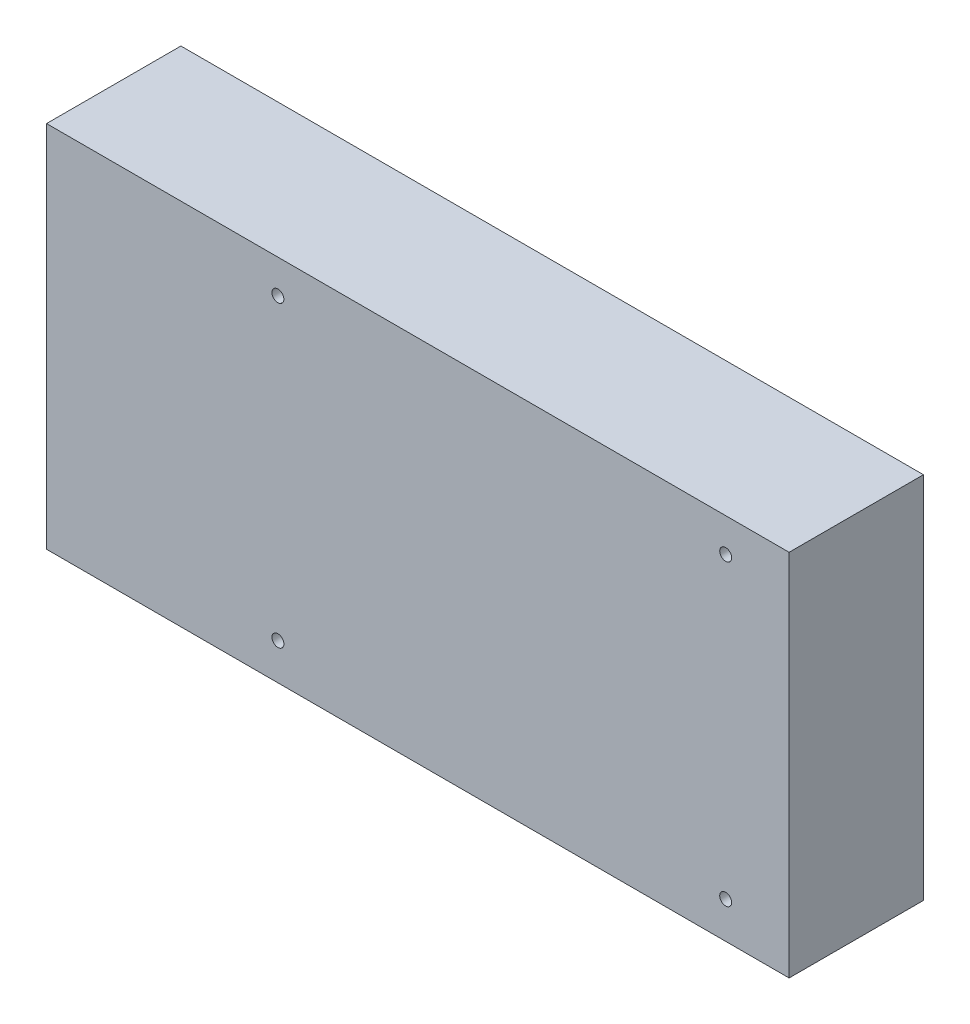
ISO-10303-21;
HEADER;
FILE_DESCRIPTION(('STEP AP214'),'2;1');
FILE_NAME('part.step','',(''),(''),'','','');
FILE_SCHEMA(('AUTOMOTIVE_DESIGN { 1 0 10303 214 1 1 1 1 }'));
ENDSEC;
DATA;
#1=APPLICATION_CONTEXT('core data for automotive mechanical design processes');
#2=APPLICATION_PROTOCOL_DEFINITION('international standard','automotive_design',2000,#1);
#3=PRODUCT_CONTEXT('',#1,'mechanical');
#4=PRODUCT('Part','Part','',(#3));
#5=PRODUCT_RELATED_PRODUCT_CATEGORY('part','',(#4));
#6=PRODUCT_DEFINITION_FORMATION('','',#4);
#7=PRODUCT_DEFINITION_CONTEXT('part definition',#1,'design');
#8=PRODUCT_DEFINITION('design','',#6,#7);
#9=PRODUCT_DEFINITION_SHAPE('','',#8);
#10=(LENGTH_UNIT() NAMED_UNIT(*) SI_UNIT(.MILLI.,.METRE.));
#11=(NAMED_UNIT(*) PLANE_ANGLE_UNIT() SI_UNIT($,.RADIAN.));
#12=(NAMED_UNIT(*) SI_UNIT($,.STERADIAN.) SOLID_ANGLE_UNIT());
#13=UNCERTAINTY_MEASURE_WITH_UNIT(LENGTH_MEASURE(1.E-05),#10,'distance_accuracy_value','');
#14=(GEOMETRIC_REPRESENTATION_CONTEXT(3) GLOBAL_UNCERTAINTY_ASSIGNED_CONTEXT((#13)) GLOBAL_UNIT_ASSIGNED_CONTEXT((#10,
#11,#12)) REPRESENTATION_CONTEXT('',''));
#15=CARTESIAN_POINT('',(0.,0.,0.));
#16=DIRECTION('',(0.,0.,1.));
#17=DIRECTION('',(1.,0.,0.));
#18=AXIS2_PLACEMENT_3D('',#15,#16,#17);
#19=CARTESIAN_POINT('',(99.5,-49.403,36.));
#20=DIRECTION('',(-1.,0.,0.));
#21=DIRECTION('',(0.,0.,1.));
#22=AXIS2_PLACEMENT_3D('',#19,#20,#21);
#23=PLANE('',#22);
#24=DIRECTION('',(0.,1.,0.));
#25=VECTOR('',#24,1.);
#26=CARTESIAN_POINT('',(99.5,-49.403,0.));
#27=LINE('',#26,#25);
#28=CARTESIAN_POINT('',(99.5,-49.403,0.));
#29=VERTEX_POINT('',#28);
#30=CARTESIAN_POINT('',(99.5,49.403,0.));
#31=VERTEX_POINT('',#30);
#32=EDGE_CURVE('E102',#29,#31,#27,.T.);
#33=ORIENTED_EDGE('',*,*,#32,.T.);
#34=DIRECTION('',(0.,0.,-1.));
#35=VECTOR('',#34,1.);
#36=CARTESIAN_POINT('',(99.5,49.403,36.));
#37=LINE('',#36,#35);
#38=CARTESIAN_POINT('',(99.5,49.403,36.));
#39=VERTEX_POINT('',#38);
#40=EDGE_CURVE('E93',#39,#31,#37,.T.);
#41=ORIENTED_EDGE('',*,*,#40,.F.);
#42=DIRECTION('',(0.,1.,0.));
#43=VECTOR('',#42,1.);
#44=CARTESIAN_POINT('',(99.5,-49.403,36.));
#45=LINE('',#44,#43);
#46=CARTESIAN_POINT('',(99.5,-49.403,36.));
#47=VERTEX_POINT('',#46);
#48=EDGE_CURVE('E87',#47,#39,#45,.T.);
#49=ORIENTED_EDGE('',*,*,#48,.F.);
#50=DIRECTION('',(0.,0.,-1.));
#51=VECTOR('',#50,1.);
#52=CARTESIAN_POINT('',(99.5,-49.403,36.));
#53=LINE('',#52,#51);
#54=EDGE_CURVE('E98',#47,#29,#53,.T.);
#55=ORIENTED_EDGE('',*,*,#54,.T.);
#56=EDGE_LOOP('',(#33,#41,#49,#55));
#57=FACE_BOUND('',#56,.T.);
#58=ADVANCED_FACE('F33',(#57),#23,.F.);
#59=CARTESIAN_POINT('',(-99.5,49.403,36.));
#60=DIRECTION('',(0.,-1.,0.));
#61=DIRECTION('',(0.,0.,-1.));
#62=AXIS2_PLACEMENT_3D('',#59,#60,#61);
#63=PLANE('',#62);
#64=DIRECTION('',(-1.,0.,0.));
#65=VECTOR('',#64,1.);
#66=CARTESIAN_POINT('',(-99.5,49.403,0.));
#67=LINE('',#66,#65);
#68=CARTESIAN_POINT('',(-99.5,49.403,0.));
#69=VERTEX_POINT('',#68);
#70=EDGE_CURVE('E92',#31,#69,#67,.T.);
#71=ORIENTED_EDGE('',*,*,#70,.T.);
#72=DIRECTION('',(0.,0.,-1.));
#73=VECTOR('',#72,1.);
#74=CARTESIAN_POINT('',(-99.5,49.403,36.));
#75=LINE('',#74,#73);
#76=CARTESIAN_POINT('',(-99.5,49.403,36.));
#77=VERTEX_POINT('',#76);
#78=EDGE_CURVE('E90',#77,#69,#75,.T.);
#79=ORIENTED_EDGE('',*,*,#78,.F.);
#80=DIRECTION('',(-1.,0.,0.));
#81=VECTOR('',#80,1.);
#82=CARTESIAN_POINT('',(-99.5,49.403,36.));
#83=LINE('',#82,#81);
#84=EDGE_CURVE('E81',#39,#77,#83,.T.);
#85=ORIENTED_EDGE('',*,*,#84,.F.);
#86=ORIENTED_EDGE('',*,*,#40,.T.);
#87=EDGE_LOOP('',(#71,#79,#85,#86));
#88=FACE_BOUND('',#87,.T.);
#89=ADVANCED_FACE('F91',(#88),#63,.F.);
#90=CARTESIAN_POINT('',(-99.5,-49.403,36.));
#91=DIRECTION('',(1.,0.,0.));
#92=DIRECTION('',(0.,0.,-1.));
#93=AXIS2_PLACEMENT_3D('',#90,#91,#92);
#94=PLANE('',#93);
#95=DIRECTION('',(0.,-1.,0.));
#96=VECTOR('',#95,1.);
#97=CARTESIAN_POINT('',(-99.5,-49.403,0.));
#98=LINE('',#97,#96);
#99=CARTESIAN_POINT('',(-99.5,-49.403,0.));
#100=VERTEX_POINT('',#99);
#101=EDGE_CURVE('E67',#69,#100,#98,.T.);
#102=ORIENTED_EDGE('',*,*,#101,.T.);
#103=DIRECTION('',(0.,0.,-1.));
#104=VECTOR('',#103,1.);
#105=CARTESIAN_POINT('',(-99.5,-49.403,36.));
#106=LINE('',#105,#104);
#107=CARTESIAN_POINT('',(-99.5,-49.403,36.));
#108=VERTEX_POINT('',#107);
#109=EDGE_CURVE('E94',#108,#100,#106,.T.);
#110=ORIENTED_EDGE('',*,*,#109,.F.);
#111=DIRECTION('',(0.,-1.,0.));
#112=VECTOR('',#111,1.);
#113=CARTESIAN_POINT('',(-99.5,-49.403,36.));
#114=LINE('',#113,#112);
#115=EDGE_CURVE('E85',#77,#108,#114,.T.);
#116=ORIENTED_EDGE('',*,*,#115,.F.);
#117=ORIENTED_EDGE('',*,*,#78,.T.);
#118=EDGE_LOOP('',(#102,#110,#116,#117));
#119=FACE_BOUND('',#118,.T.);
#120=ADVANCED_FACE('F96',(#119),#94,.F.);
#121=CARTESIAN_POINT('',(-99.5,-49.403,36.));
#122=DIRECTION('',(0.,1.,0.));
#123=DIRECTION('',(0.,0.,1.));
#124=AXIS2_PLACEMENT_3D('',#121,#122,#123);
#125=PLANE('',#124);
#126=DIRECTION('',(1.,0.,0.));
#127=VECTOR('',#126,1.);
#128=CARTESIAN_POINT('',(-99.5,-49.403,0.));
#129=LINE('',#128,#127);
#130=EDGE_CURVE('E73',#100,#29,#129,.T.);
#131=ORIENTED_EDGE('',*,*,#130,.T.);
#132=ORIENTED_EDGE('',*,*,#54,.F.);
#133=DIRECTION('',(1.,0.,0.));
#134=VECTOR('',#133,1.);
#135=CARTESIAN_POINT('',(-99.5,-49.403,36.));
#136=LINE('',#135,#134);
#137=EDGE_CURVE('E50',#108,#47,#136,.T.);
#138=ORIENTED_EDGE('',*,*,#137,.F.);
#139=ORIENTED_EDGE('',*,*,#109,.T.);
#140=EDGE_LOOP('',(#131,#132,#138,#139));
#141=FACE_BOUND('',#140,.T.);
#142=ADVANCED_FACE('F128',(#141),#125,.F.);
#143=CARTESIAN_POINT('',(0.,0.,36.));
#144=DIRECTION('',(0.,0.,-1.));
#145=DIRECTION('',(-1.,0.,0.));
#146=AXIS2_PLACEMENT_3D('',#143,#144,#145);
#147=PLANE('',#146);
#148=CARTESIAN_POINT('',(82.5,40.403,36.));
#149=DIRECTION('',(0.,0.,1.));
#150=DIRECTION('',(1.,0.,0.));
#151=AXIS2_PLACEMENT_3D('',#148,#149,#150);
#152=CIRCLE('',#151,1.6);
#153=CARTESIAN_POINT('',(84.1,40.403,36.));
#154=VERTEX_POINT('',#153);
#155=EDGE_CURVE('E171',#154,#154,#152,.T.);
#156=ORIENTED_EDGE('',*,*,#155,.F.);
#157=EDGE_LOOP('',(#156));
#158=FACE_BOUND('',#157,.T.);
#159=CARTESIAN_POINT('',(-37.5,40.403,36.));
#160=DIRECTION('',(0.,0.,1.));
#161=DIRECTION('',(1.,0.,0.));
#162=AXIS2_PLACEMENT_3D('',#159,#160,#161);
#163=CIRCLE('',#162,1.6);
#164=CARTESIAN_POINT('',(-35.9,40.403,36.));
#165=VERTEX_POINT('',#164);
#166=EDGE_CURVE('E172',#165,#165,#163,.T.);
#167=ORIENTED_EDGE('',*,*,#166,.F.);
#168=EDGE_LOOP('',(#167));
#169=FACE_BOUND('',#168,.T.);
#170=ORIENTED_EDGE('',*,*,#48,.T.);
#171=ORIENTED_EDGE('',*,*,#84,.T.);
#172=ORIENTED_EDGE('',*,*,#115,.T.);
#173=ORIENTED_EDGE('',*,*,#137,.T.);
#174=EDGE_LOOP('',(#170,#171,#172,#173));
#175=FACE_BOUND('',#174,.T.);
#176=CARTESIAN_POINT('',(-37.5,-39.597,36.));
#177=DIRECTION('',(0.,0.,1.));
#178=DIRECTION('',(1.,0.,0.));
#179=AXIS2_PLACEMENT_3D('',#176,#177,#178);
#180=CIRCLE('',#179,1.6);
#181=CARTESIAN_POINT('',(-35.9,-39.597,36.));
#182=VERTEX_POINT('',#181);
#183=EDGE_CURVE('E115',#182,#182,#180,.T.);
#184=ORIENTED_EDGE('',*,*,#183,.F.);
#185=EDGE_LOOP('',(#184));
#186=FACE_BOUND('',#185,.T.);
#187=CARTESIAN_POINT('',(82.5,-39.597,36.));
#188=DIRECTION('',(0.,0.,1.));
#189=DIRECTION('',(1.,0.,0.));
#190=AXIS2_PLACEMENT_3D('',#187,#188,#189);
#191=CIRCLE('',#190,1.6);
#192=CARTESIAN_POINT('',(84.1,-39.597,36.));
#193=VERTEX_POINT('',#192);
#194=EDGE_CURVE('E11',#193,#193,#191,.T.);
#195=ORIENTED_EDGE('',*,*,#194,.F.);
#196=EDGE_LOOP('',(#195));
#197=FACE_BOUND('',#196,.T.);
#198=ADVANCED_FACE('F82',(#158,#169,#175,#186,#197),#147,.F.);
#199=CARTESIAN_POINT('',(0.,0.,0.));
#200=DIRECTION('',(0.,0.,-1.));
#201=DIRECTION('',(-1.,0.,0.));
#202=AXIS2_PLACEMENT_3D('',#199,#200,#201);
#203=PLANE('',#202);
#204=CARTESIAN_POINT('',(82.5,40.403,0.));
#205=DIRECTION('',(0.,0.,1.));
#206=DIRECTION('',(1.,0.,0.));
#207=AXIS2_PLACEMENT_3D('',#204,#205,#206);
#208=CIRCLE('',#207,1.6);
#209=CARTESIAN_POINT('',(84.1,40.403,0.));
#210=VERTEX_POINT('',#209);
#211=EDGE_CURVE('E169',#210,#210,#208,.T.);
#212=ORIENTED_EDGE('',*,*,#211,.T.);
#213=EDGE_LOOP('',(#212));
#214=FACE_BOUND('',#213,.T.);
#215=CARTESIAN_POINT('',(-37.5,40.403,0.));
#216=DIRECTION('',(0.,0.,1.));
#217=DIRECTION('',(1.,0.,0.));
#218=AXIS2_PLACEMENT_3D('',#215,#216,#217);
#219=CIRCLE('',#218,1.6);
#220=CARTESIAN_POINT('',(-35.9,40.403,0.));
#221=VERTEX_POINT('',#220);
#222=EDGE_CURVE('E105',#221,#221,#219,.T.);
#223=ORIENTED_EDGE('',*,*,#222,.T.);
#224=EDGE_LOOP('',(#223));
#225=FACE_BOUND('',#224,.T.);
#226=ORIENTED_EDGE('',*,*,#32,.F.);
#227=ORIENTED_EDGE('',*,*,#130,.F.);
#228=ORIENTED_EDGE('',*,*,#101,.F.);
#229=ORIENTED_EDGE('',*,*,#70,.F.);
#230=EDGE_LOOP('',(#226,#227,#228,#229));
#231=FACE_BOUND('',#230,.T.);
#232=CARTESIAN_POINT('',(-37.5,-39.597,0.));
#233=DIRECTION('',(0.,0.,1.));
#234=DIRECTION('',(1.,0.,0.));
#235=AXIS2_PLACEMENT_3D('',#232,#233,#234);
#236=CIRCLE('',#235,1.6);
#237=CARTESIAN_POINT('',(-35.9,-39.597,0.));
#238=VERTEX_POINT('',#237);
#239=EDGE_CURVE('E112',#238,#238,#236,.T.);
#240=ORIENTED_EDGE('',*,*,#239,.T.);
#241=EDGE_LOOP('',(#240));
#242=FACE_BOUND('',#241,.T.);
#243=CARTESIAN_POINT('',(82.5,-39.597,0.));
#244=DIRECTION('',(0.,0.,1.));
#245=DIRECTION('',(1.,0.,0.));
#246=AXIS2_PLACEMENT_3D('',#243,#244,#245);
#247=CIRCLE('',#246,1.6);
#248=CARTESIAN_POINT('',(84.1,-39.597,0.));
#249=VERTEX_POINT('',#248);
#250=EDGE_CURVE('E42',#249,#249,#247,.T.);
#251=ORIENTED_EDGE('',*,*,#250,.T.);
#252=EDGE_LOOP('',(#251));
#253=FACE_BOUND('',#252,.T.);
#254=ADVANCED_FACE('F120',(#214,#225,#231,#242,#253),#203,.T.);
#255=CARTESIAN_POINT('',(-37.5,40.403,0.));
#256=DIRECTION('',(0.,0.,1.));
#257=DIRECTION('',(1.,0.,0.));
#258=AXIS2_PLACEMENT_3D('',#255,#256,#257);
#259=CYLINDRICAL_SURFACE('',#258,1.6);
#260=ORIENTED_EDGE('',*,*,#222,.F.);
#261=EDGE_LOOP('',(#260));
#262=FACE_BOUND('',#261,.T.);
#263=ORIENTED_EDGE('',*,*,#166,.T.);
#264=EDGE_LOOP('',(#263));
#265=FACE_BOUND('',#264,.T.);
#266=ADVANCED_FACE('F135',(#262,#265),#259,.F.);
#267=CARTESIAN_POINT('',(82.5,40.403,0.));
#268=DIRECTION('',(0.,0.,1.));
#269=DIRECTION('',(1.,0.,0.));
#270=AXIS2_PLACEMENT_3D('',#267,#268,#269);
#271=CYLINDRICAL_SURFACE('',#270,1.6);
#272=ORIENTED_EDGE('',*,*,#211,.F.);
#273=EDGE_LOOP('',(#272));
#274=FACE_BOUND('',#273,.T.);
#275=ORIENTED_EDGE('',*,*,#155,.T.);
#276=EDGE_LOOP('',(#275));
#277=FACE_BOUND('',#276,.T.);
#278=ADVANCED_FACE('F151',(#274,#277),#271,.F.);
#279=CARTESIAN_POINT('',(-37.5,-39.597,0.));
#280=DIRECTION('',(0.,0.,1.));
#281=DIRECTION('',(1.,0.,0.));
#282=AXIS2_PLACEMENT_3D('',#279,#280,#281);
#283=CYLINDRICAL_SURFACE('',#282,1.6);
#284=ORIENTED_EDGE('',*,*,#239,.F.);
#285=EDGE_LOOP('',(#284));
#286=FACE_BOUND('',#285,.T.);
#287=ORIENTED_EDGE('',*,*,#183,.T.);
#288=EDGE_LOOP('',(#287));
#289=FACE_BOUND('',#288,.T.);
#290=ADVANCED_FACE('F124',(#286,#289),#283,.F.);
#291=CARTESIAN_POINT('',(82.5,-39.597,0.));
#292=DIRECTION('',(0.,0.,1.));
#293=DIRECTION('',(1.,0.,0.));
#294=AXIS2_PLACEMENT_3D('',#291,#292,#293);
#295=CYLINDRICAL_SURFACE('',#294,1.6);
#296=ORIENTED_EDGE('',*,*,#250,.F.);
#297=EDGE_LOOP('',(#296));
#298=FACE_BOUND('',#297,.T.);
#299=ORIENTED_EDGE('',*,*,#194,.T.);
#300=EDGE_LOOP('',(#299));
#301=FACE_BOUND('',#300,.T.);
#302=ADVANCED_FACE('F35',(#298,#301),#295,.F.);
#303=CLOSED_SHELL('',(#58,#89,#120,#142,#198,#254,#266,#278,#290,#302));
#304=MANIFOLD_SOLID_BREP('B2',#303);
#305=ADVANCED_BREP_SHAPE_REPRESENTATION('',(#18,#304),#14);
#306=SHAPE_DEFINITION_REPRESENTATION(#9,#305);
ENDSEC;
END-ISO-10303-21;
